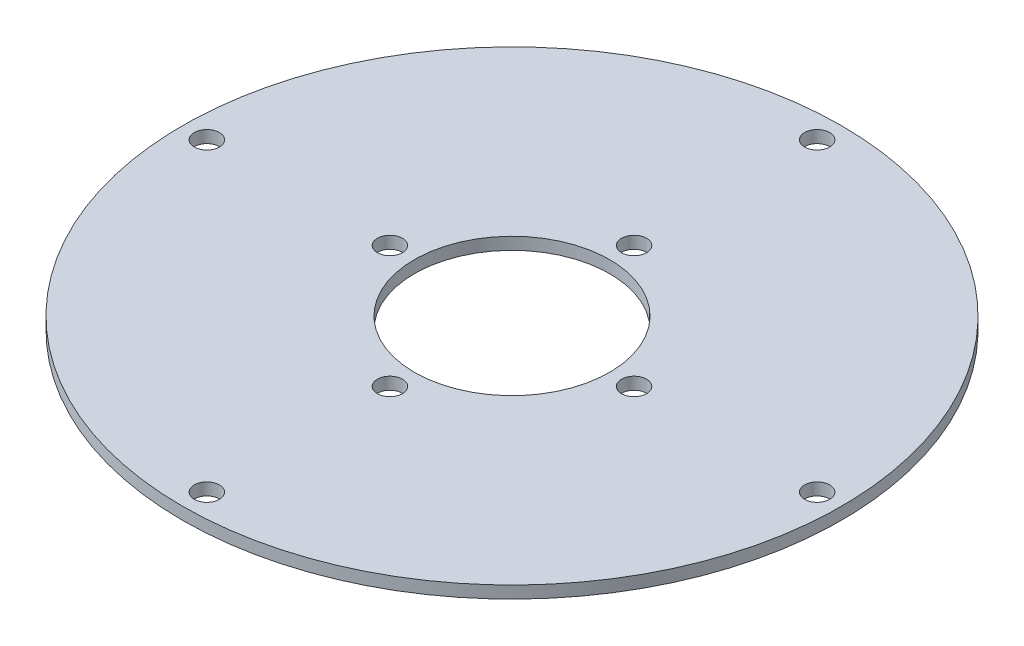
ISO-10303-21;
HEADER;
FILE_DESCRIPTION(('STEP AP214'),'2;1');
FILE_NAME('part.step','',(''),(''),'','','');
FILE_SCHEMA(('AUTOMOTIVE_DESIGN { 1 0 10303 214 1 1 1 1 }'));
ENDSEC;
DATA;
#1=APPLICATION_CONTEXT('core data for automotive mechanical design processes');
#2=APPLICATION_PROTOCOL_DEFINITION('international standard','automotive_design',2000,#1);
#3=PRODUCT_CONTEXT('',#1,'mechanical');
#4=PRODUCT('Part','Part','',(#3));
#5=PRODUCT_RELATED_PRODUCT_CATEGORY('part','',(#4));
#6=PRODUCT_DEFINITION_FORMATION('','',#4);
#7=PRODUCT_DEFINITION_CONTEXT('part definition',#1,'design');
#8=PRODUCT_DEFINITION('design','',#6,#7);
#9=PRODUCT_DEFINITION_SHAPE('','',#8);
#10=(LENGTH_UNIT() NAMED_UNIT(*) SI_UNIT(.MILLI.,.METRE.));
#11=(NAMED_UNIT(*) PLANE_ANGLE_UNIT() SI_UNIT($,.RADIAN.));
#12=(NAMED_UNIT(*) SI_UNIT($,.STERADIAN.) SOLID_ANGLE_UNIT());
#13=UNCERTAINTY_MEASURE_WITH_UNIT(LENGTH_MEASURE(1.E-05),#10,'distance_accuracy_value','');
#14=(GEOMETRIC_REPRESENTATION_CONTEXT(3) GLOBAL_UNCERTAINTY_ASSIGNED_CONTEXT((#13)) GLOBAL_UNIT_ASSIGNED_CONTEXT((#10,
#11,#12)) REPRESENTATION_CONTEXT('',''));
#15=CARTESIAN_POINT('',(0.,0.,0.));
#16=DIRECTION('',(0.,0.,1.));
#17=DIRECTION('',(1.,0.,0.));
#18=AXIS2_PLACEMENT_3D('',#15,#16,#17);
#19=CARTESIAN_POINT('',(0.,3.175,0.));
#20=DIRECTION('',(0.,1.,0.));
#21=DIRECTION('',(0.,0.,1.));
#22=AXIS2_PLACEMENT_3D('',#19,#20,#21);
#23=PLANE('',#22);
#24=CARTESIAN_POINT('',(1.79311378806878E-12,3.175,31.75));
#25=DIRECTION('',(0.,1.,0.));
#26=DIRECTION('',(0.,0.,1.));
#27=AXIS2_PLACEMENT_3D('',#24,#25,#26);
#28=CIRCLE('',#27,3.26390000000193);
#29=CARTESIAN_POINT('',(1.79311378806878E-12,3.175,35.0139000000019));
#30=VERTEX_POINT('',#29);
#31=EDGE_CURVE('E87',#30,#30,#28,.T.);
#32=ORIENTED_EDGE('',*,*,#31,.F.);
#33=EDGE_LOOP('',(#32));
#34=FACE_BOUND('',#33,.T.);
#35=CARTESIAN_POINT('',(-79.3749999999978,3.175,2.2511128690542E-12));
#36=DIRECTION('',(0.,1.,0.));
#37=DIRECTION('',(0.,0.,1.));
#38=AXIS2_PLACEMENT_3D('',#35,#36,#37);
#39=CIRCLE('',#38,3.2639000000036);
#40=CARTESIAN_POINT('',(-79.3749999999978,3.175,3.26390000000585));
#41=VERTEX_POINT('',#40);
#42=EDGE_CURVE('E75',#41,#41,#39,.T.);
#43=ORIENTED_EDGE('',*,*,#42,.F.);
#44=EDGE_LOOP('',(#43));
#45=FACE_BOUND('',#44,.T.);
#46=CARTESIAN_POINT('',(79.3750000000022,3.175,-2.24139223508597E-12));
#47=DIRECTION('',(0.,1.,0.));
#48=DIRECTION('',(0.,0.,1.));
#49=AXIS2_PLACEMENT_3D('',#46,#47,#48);
#50=CIRCLE('',#49,3.26390000000175);
#51=CARTESIAN_POINT('',(79.3750000000022,3.175,3.26389999999951));
#52=VERTEX_POINT('',#51);
#53=EDGE_CURVE('E63',#52,#52,#50,.T.);
#54=ORIENTED_EDGE('',*,*,#53,.F.);
#55=EDGE_LOOP('',(#54));
#56=FACE_BOUND('',#55,.T.);
#57=CARTESIAN_POINT('',(0.,3.175,-79.375));
#58=DIRECTION('',(0.,1.,0.));
#59=DIRECTION('',(0.,0.,1.));
#60=AXIS2_PLACEMENT_3D('',#57,#58,#59);
#61=CIRCLE('',#60,3.2639);
#62=CARTESIAN_POINT('',(0.,3.175,-76.1111));
#63=VERTEX_POINT('',#62);
#64=EDGE_CURVE('E51',#63,#63,#61,.T.);
#65=ORIENTED_EDGE('',*,*,#64,.F.);
#66=EDGE_LOOP('',(#65));
#67=FACE_BOUND('',#66,.T.);
#68=CARTESIAN_POINT('',(0.,3.175,0.));
#69=DIRECTION('',(0.,1.,0.));
#70=DIRECTION('',(0.,0.,1.));
#71=AXIS2_PLACEMENT_3D('',#68,#69,#70);
#72=CIRCLE('',#71,85.725);
#73=CARTESIAN_POINT('',(0.,3.175,85.725));
#74=VERTEX_POINT('',#73);
#75=EDGE_CURVE('E10',#74,#74,#72,.T.);
#76=ORIENTED_EDGE('',*,*,#75,.T.);
#77=EDGE_LOOP('',(#76));
#78=FACE_BOUND('',#77,.T.);
#79=CARTESIAN_POINT('',(0.,3.175,0.));
#80=DIRECTION('',(0.,1.,0.));
#81=DIRECTION('',(0.,0.,1.));
#82=AXIS2_PLACEMENT_3D('',#79,#80,#81);
#83=CIRCLE('',#82,25.4);
#84=CARTESIAN_POINT('',(0.,3.175,25.4));
#85=VERTEX_POINT('',#84);
#86=EDGE_CURVE('E46',#85,#85,#83,.T.);
#87=ORIENTED_EDGE('',*,*,#86,.F.);
#88=EDGE_LOOP('',(#87));
#89=FACE_BOUND('',#88,.T.);
#90=CARTESIAN_POINT('',(0.,3.175,-31.75));
#91=DIRECTION('',(0.,1.,0.));
#92=DIRECTION('',(0.,0.,1.));
#93=AXIS2_PLACEMENT_3D('',#90,#91,#92);
#94=CIRCLE('',#93,3.2639);
#95=CARTESIAN_POINT('',(0.,3.175,-28.4861));
#96=VERTEX_POINT('',#95);
#97=EDGE_CURVE('E57',#96,#96,#94,.T.);
#98=ORIENTED_EDGE('',*,*,#97,.F.);
#99=EDGE_LOOP('',(#98));
#100=FACE_BOUND('',#99,.T.);
#101=CARTESIAN_POINT('',(4.4835621208894E-12,3.175,79.375));
#102=DIRECTION('',(0.,1.,0.));
#103=DIRECTION('',(0.,0.,1.));
#104=AXIS2_PLACEMENT_3D('',#101,#102,#103);
#105=CIRCLE('',#104,3.26390000000481);
#106=CARTESIAN_POINT('',(4.4835621208894E-12,3.175,82.6389000000048));
#107=VERTEX_POINT('',#106);
#108=EDGE_CURVE('E69',#107,#107,#105,.T.);
#109=ORIENTED_EDGE('',*,*,#108,.F.);
#110=EDGE_LOOP('',(#109));
#111=FACE_BOUND('',#110,.T.);
#112=CARTESIAN_POINT('',(31.75,3.175,1.10854532508269E-13));
#113=DIRECTION('',(0.,1.,0.));
#114=DIRECTION('',(0.,0.,1.));
#115=AXIS2_PLACEMENT_3D('',#112,#113,#114);
#116=CIRCLE('',#115,3.2639);
#117=CARTESIAN_POINT('',(31.75,3.175,3.26390000000011));
#118=VERTEX_POINT('',#117);
#119=EDGE_CURVE('E81',#118,#118,#116,.T.);
#120=ORIENTED_EDGE('',*,*,#119,.F.);
#121=EDGE_LOOP('',(#120));
#122=FACE_BOUND('',#121,.T.);
#123=CARTESIAN_POINT('',(-31.75,3.175,-3.32563597524808E-13));
#124=DIRECTION('',(0.,1.,0.));
#125=DIRECTION('',(0.,0.,1.));
#126=AXIS2_PLACEMENT_3D('',#123,#124,#125);
#127=CIRCLE('',#126,3.2639);
#128=CARTESIAN_POINT('',(-31.75,3.175,3.26389999999967));
#129=VERTEX_POINT('',#128);
#130=EDGE_CURVE('E93',#129,#129,#127,.T.);
#131=ORIENTED_EDGE('',*,*,#130,.F.);
#132=EDGE_LOOP('',(#131));
#133=FACE_BOUND('',#132,.T.);
#134=ADVANCED_FACE('F35',(#34,#45,#56,#67,#78,#89,#100,#111,#122,#133),#23,.T.);
#135=CARTESIAN_POINT('',(0.,0.,0.));
#136=DIRECTION('',(0.,1.,0.));
#137=DIRECTION('',(0.,0.,1.));
#138=AXIS2_PLACEMENT_3D('',#135,#136,#137);
#139=PLANE('',#138);
#140=CARTESIAN_POINT('',(0.,0.,0.));
#141=DIRECTION('',(0.,1.,0.));
#142=DIRECTION('',(0.,0.,1.));
#143=AXIS2_PLACEMENT_3D('',#140,#141,#142);
#144=CIRCLE('',#143,85.725);
#145=CARTESIAN_POINT('',(0.,0.,85.725));
#146=VERTEX_POINT('',#145);
#147=EDGE_CURVE('E39',#146,#146,#144,.T.);
#148=ORIENTED_EDGE('',*,*,#147,.F.);
#149=EDGE_LOOP('',(#148));
#150=FACE_BOUND('',#149,.T.);
#151=CARTESIAN_POINT('',(0.,0.,0.));
#152=DIRECTION('',(0.,1.,0.));
#153=DIRECTION('',(0.,0.,1.));
#154=AXIS2_PLACEMENT_3D('',#151,#152,#153);
#155=CIRCLE('',#154,25.4);
#156=CARTESIAN_POINT('',(0.,0.,25.4));
#157=VERTEX_POINT('',#156);
#158=EDGE_CURVE('E48',#157,#157,#155,.T.);
#159=ORIENTED_EDGE('',*,*,#158,.T.);
#160=EDGE_LOOP('',(#159));
#161=FACE_BOUND('',#160,.T.);
#162=CARTESIAN_POINT('',(0.,0.,-79.375));
#163=DIRECTION('',(0.,1.,0.));
#164=DIRECTION('',(0.,0.,1.));
#165=AXIS2_PLACEMENT_3D('',#162,#163,#164);
#166=CIRCLE('',#165,3.2639);
#167=CARTESIAN_POINT('',(0.,0.,-76.1111));
#168=VERTEX_POINT('',#167);
#169=EDGE_CURVE('E54',#168,#168,#166,.T.);
#170=ORIENTED_EDGE('',*,*,#169,.T.);
#171=EDGE_LOOP('',(#170));
#172=FACE_BOUND('',#171,.T.);
#173=CARTESIAN_POINT('',(0.,0.,-31.75));
#174=DIRECTION('',(0.,1.,0.));
#175=DIRECTION('',(0.,0.,1.));
#176=AXIS2_PLACEMENT_3D('',#173,#174,#175);
#177=CIRCLE('',#176,3.2639);
#178=CARTESIAN_POINT('',(0.,0.,-28.4861));
#179=VERTEX_POINT('',#178);
#180=EDGE_CURVE('E60',#179,#179,#177,.T.);
#181=ORIENTED_EDGE('',*,*,#180,.T.);
#182=EDGE_LOOP('',(#181));
#183=FACE_BOUND('',#182,.T.);
#184=CARTESIAN_POINT('',(79.3750000000022,0.,-2.24139223508597E-12));
#185=DIRECTION('',(0.,1.,0.));
#186=DIRECTION('',(0.,0.,1.));
#187=AXIS2_PLACEMENT_3D('',#184,#185,#186);
#188=CIRCLE('',#187,3.26390000000175);
#189=CARTESIAN_POINT('',(79.3750000000022,0.,3.26389999999951));
#190=VERTEX_POINT('',#189);
#191=EDGE_CURVE('E66',#190,#190,#188,.T.);
#192=ORIENTED_EDGE('',*,*,#191,.T.);
#193=EDGE_LOOP('',(#192));
#194=FACE_BOUND('',#193,.T.);
#195=CARTESIAN_POINT('',(4.4835621208894E-12,0.,79.375));
#196=DIRECTION('',(0.,1.,0.));
#197=DIRECTION('',(0.,0.,1.));
#198=AXIS2_PLACEMENT_3D('',#195,#196,#197);
#199=CIRCLE('',#198,3.26390000000481);
#200=CARTESIAN_POINT('',(4.4835621208894E-12,0.,82.6389000000048));
#201=VERTEX_POINT('',#200);
#202=EDGE_CURVE('E72',#201,#201,#199,.T.);
#203=ORIENTED_EDGE('',*,*,#202,.T.);
#204=EDGE_LOOP('',(#203));
#205=FACE_BOUND('',#204,.T.);
#206=CARTESIAN_POINT('',(-79.3749999999978,0.,2.2511128690542E-12));
#207=DIRECTION('',(0.,1.,0.));
#208=DIRECTION('',(0.,0.,1.));
#209=AXIS2_PLACEMENT_3D('',#206,#207,#208);
#210=CIRCLE('',#209,3.2639000000036);
#211=CARTESIAN_POINT('',(-79.3749999999978,0.,3.26390000000585));
#212=VERTEX_POINT('',#211);
#213=EDGE_CURVE('E78',#212,#212,#210,.T.);
#214=ORIENTED_EDGE('',*,*,#213,.T.);
#215=EDGE_LOOP('',(#214));
#216=FACE_BOUND('',#215,.T.);
#217=CARTESIAN_POINT('',(31.75,0.,1.10854532508269E-13));
#218=DIRECTION('',(0.,1.,0.));
#219=DIRECTION('',(0.,0.,1.));
#220=AXIS2_PLACEMENT_3D('',#217,#218,#219);
#221=CIRCLE('',#220,3.2639);
#222=CARTESIAN_POINT('',(31.75,0.,3.26390000000011));
#223=VERTEX_POINT('',#222);
#224=EDGE_CURVE('E84',#223,#223,#221,.T.);
#225=ORIENTED_EDGE('',*,*,#224,.T.);
#226=EDGE_LOOP('',(#225));
#227=FACE_BOUND('',#226,.T.);
#228=CARTESIAN_POINT('',(1.79311378806878E-12,0.,31.75));
#229=DIRECTION('',(0.,1.,0.));
#230=DIRECTION('',(0.,0.,1.));
#231=AXIS2_PLACEMENT_3D('',#228,#229,#230);
#232=CIRCLE('',#231,3.26390000000193);
#233=CARTESIAN_POINT('',(1.79311378806878E-12,0.,35.0139000000019));
#234=VERTEX_POINT('',#233);
#235=EDGE_CURVE('E90',#234,#234,#232,.T.);
#236=ORIENTED_EDGE('',*,*,#235,.T.);
#237=EDGE_LOOP('',(#236));
#238=FACE_BOUND('',#237,.T.);
#239=CARTESIAN_POINT('',(-31.75,0.,-3.32563597524808E-13));
#240=DIRECTION('',(0.,1.,0.));
#241=DIRECTION('',(0.,0.,1.));
#242=AXIS2_PLACEMENT_3D('',#239,#240,#241);
#243=CIRCLE('',#242,3.2639);
#244=CARTESIAN_POINT('',(-31.75,0.,3.26389999999967));
#245=VERTEX_POINT('',#244);
#246=EDGE_CURVE('E96',#245,#245,#243,.T.);
#247=ORIENTED_EDGE('',*,*,#246,.T.);
#248=EDGE_LOOP('',(#247));
#249=FACE_BOUND('',#248,.T.);
#250=ADVANCED_FACE('F106',(#150,#161,#172,#183,#194,#205,#216,#227,#238,#249),#139,.F.);
#251=CARTESIAN_POINT('',(0.,3.175,0.));
#252=DIRECTION('',(0.,-1.,0.));
#253=DIRECTION('',(0.,0.,-1.));
#254=AXIS2_PLACEMENT_3D('',#251,#252,#253);
#255=CYLINDRICAL_SURFACE('',#254,85.725);
#256=ORIENTED_EDGE('',*,*,#75,.F.);
#257=EDGE_LOOP('',(#256));
#258=FACE_BOUND('',#257,.T.);
#259=ORIENTED_EDGE('',*,*,#147,.T.);
#260=EDGE_LOOP('',(#259));
#261=FACE_BOUND('',#260,.T.);
#262=ADVANCED_FACE('F37',(#258,#261),#255,.T.);
#263=CARTESIAN_POINT('',(0.,3.175,0.));
#264=DIRECTION('',(0.,-1.,0.));
#265=DIRECTION('',(0.,0.,-1.));
#266=AXIS2_PLACEMENT_3D('',#263,#264,#265);
#267=CYLINDRICAL_SURFACE('',#266,25.4);
#268=ORIENTED_EDGE('',*,*,#86,.T.);
#269=EDGE_LOOP('',(#268));
#270=FACE_BOUND('',#269,.T.);
#271=ORIENTED_EDGE('',*,*,#158,.F.);
#272=EDGE_LOOP('',(#271));
#273=FACE_BOUND('',#272,.T.);
#274=ADVANCED_FACE('F116',(#270,#273),#267,.F.);
#275=CARTESIAN_POINT('',(0.,3.175,-79.375));
#276=DIRECTION('',(0.,-1.,0.));
#277=DIRECTION('',(0.,0.,-1.));
#278=AXIS2_PLACEMENT_3D('',#275,#276,#277);
#279=CYLINDRICAL_SURFACE('',#278,3.2639);
#280=ORIENTED_EDGE('',*,*,#64,.T.);
#281=EDGE_LOOP('',(#280));
#282=FACE_BOUND('',#281,.T.);
#283=ORIENTED_EDGE('',*,*,#169,.F.);
#284=EDGE_LOOP('',(#283));
#285=FACE_BOUND('',#284,.T.);
#286=ADVANCED_FACE('F119',(#282,#285),#279,.F.);
#287=CARTESIAN_POINT('',(0.,3.175,-31.75));
#288=DIRECTION('',(0.,-1.,0.));
#289=DIRECTION('',(0.,0.,-1.));
#290=AXIS2_PLACEMENT_3D('',#287,#288,#289);
#291=CYLINDRICAL_SURFACE('',#290,3.2639);
#292=ORIENTED_EDGE('',*,*,#97,.T.);
#293=EDGE_LOOP('',(#292));
#294=FACE_BOUND('',#293,.T.);
#295=ORIENTED_EDGE('',*,*,#180,.F.);
#296=EDGE_LOOP('',(#295));
#297=FACE_BOUND('',#296,.T.);
#298=ADVANCED_FACE('F123',(#294,#297),#291,.F.);
#299=CARTESIAN_POINT('',(79.3750000000022,3.175,-2.24139223508597E-12));
#300=DIRECTION('',(0.,-1.,0.));
#301=DIRECTION('',(0.,0.,-1.));
#302=AXIS2_PLACEMENT_3D('',#299,#300,#301);
#303=CYLINDRICAL_SURFACE('',#302,3.26390000000175);
#304=ORIENTED_EDGE('',*,*,#53,.T.);
#305=EDGE_LOOP('',(#304));
#306=FACE_BOUND('',#305,.T.);
#307=ORIENTED_EDGE('',*,*,#191,.F.);
#308=EDGE_LOOP('',(#307));
#309=FACE_BOUND('',#308,.T.);
#310=ADVANCED_FACE('F127',(#306,#309),#303,.F.);
#311=CARTESIAN_POINT('',(4.4835621208894E-12,3.175,79.375));
#312=DIRECTION('',(0.,-1.,0.));
#313=DIRECTION('',(0.,0.,-1.));
#314=AXIS2_PLACEMENT_3D('',#311,#312,#313);
#315=CYLINDRICAL_SURFACE('',#314,3.26390000000481);
#316=ORIENTED_EDGE('',*,*,#108,.T.);
#317=EDGE_LOOP('',(#316));
#318=FACE_BOUND('',#317,.T.);
#319=ORIENTED_EDGE('',*,*,#202,.F.);
#320=EDGE_LOOP('',(#319));
#321=FACE_BOUND('',#320,.T.);
#322=ADVANCED_FACE('F131',(#318,#321),#315,.F.);
#323=CARTESIAN_POINT('',(-79.3749999999978,3.175,2.2511128690542E-12));
#324=DIRECTION('',(0.,-1.,0.));
#325=DIRECTION('',(0.,0.,-1.));
#326=AXIS2_PLACEMENT_3D('',#323,#324,#325);
#327=CYLINDRICAL_SURFACE('',#326,3.2639000000036);
#328=ORIENTED_EDGE('',*,*,#42,.T.);
#329=EDGE_LOOP('',(#328));
#330=FACE_BOUND('',#329,.T.);
#331=ORIENTED_EDGE('',*,*,#213,.F.);
#332=EDGE_LOOP('',(#331));
#333=FACE_BOUND('',#332,.T.);
#334=ADVANCED_FACE('F135',(#330,#333),#327,.F.);
#335=CARTESIAN_POINT('',(31.75,3.175,1.10854532508269E-13));
#336=DIRECTION('',(0.,-1.,0.));
#337=DIRECTION('',(0.,0.,-1.));
#338=AXIS2_PLACEMENT_3D('',#335,#336,#337);
#339=CYLINDRICAL_SURFACE('',#338,3.2639);
#340=ORIENTED_EDGE('',*,*,#119,.T.);
#341=EDGE_LOOP('',(#340));
#342=FACE_BOUND('',#341,.T.);
#343=ORIENTED_EDGE('',*,*,#224,.F.);
#344=EDGE_LOOP('',(#343));
#345=FACE_BOUND('',#344,.T.);
#346=ADVANCED_FACE('F139',(#342,#345),#339,.F.);
#347=CARTESIAN_POINT('',(1.79311378806878E-12,3.175,31.75));
#348=DIRECTION('',(0.,-1.,0.));
#349=DIRECTION('',(0.,0.,-1.));
#350=AXIS2_PLACEMENT_3D('',#347,#348,#349);
#351=CYLINDRICAL_SURFACE('',#350,3.26390000000193);
#352=ORIENTED_EDGE('',*,*,#31,.T.);
#353=EDGE_LOOP('',(#352));
#354=FACE_BOUND('',#353,.T.);
#355=ORIENTED_EDGE('',*,*,#235,.F.);
#356=EDGE_LOOP('',(#355));
#357=FACE_BOUND('',#356,.T.);
#358=ADVANCED_FACE('F143',(#354,#357),#351,.F.);
#359=CARTESIAN_POINT('',(-31.75,3.175,-3.32563597524808E-13));
#360=DIRECTION('',(0.,-1.,0.));
#361=DIRECTION('',(0.,0.,-1.));
#362=AXIS2_PLACEMENT_3D('',#359,#360,#361);
#363=CYLINDRICAL_SURFACE('',#362,3.2639);
#364=ORIENTED_EDGE('',*,*,#130,.T.);
#365=EDGE_LOOP('',(#364));
#366=FACE_BOUND('',#365,.T.);
#367=ORIENTED_EDGE('',*,*,#246,.F.);
#368=EDGE_LOOP('',(#367));
#369=FACE_BOUND('',#368,.T.);
#370=ADVANCED_FACE('F102',(#366,#369),#363,.F.);
#371=CLOSED_SHELL('',(#134,#250,#262,#274,#286,#298,#310,#322,#334,#346,#358,#370));
#372=MANIFOLD_SOLID_BREP('B2',#371);
#373=ADVANCED_BREP_SHAPE_REPRESENTATION('',(#18,#372),#14);
#374=SHAPE_DEFINITION_REPRESENTATION(#9,#373);
ENDSEC;
END-ISO-10303-21;
